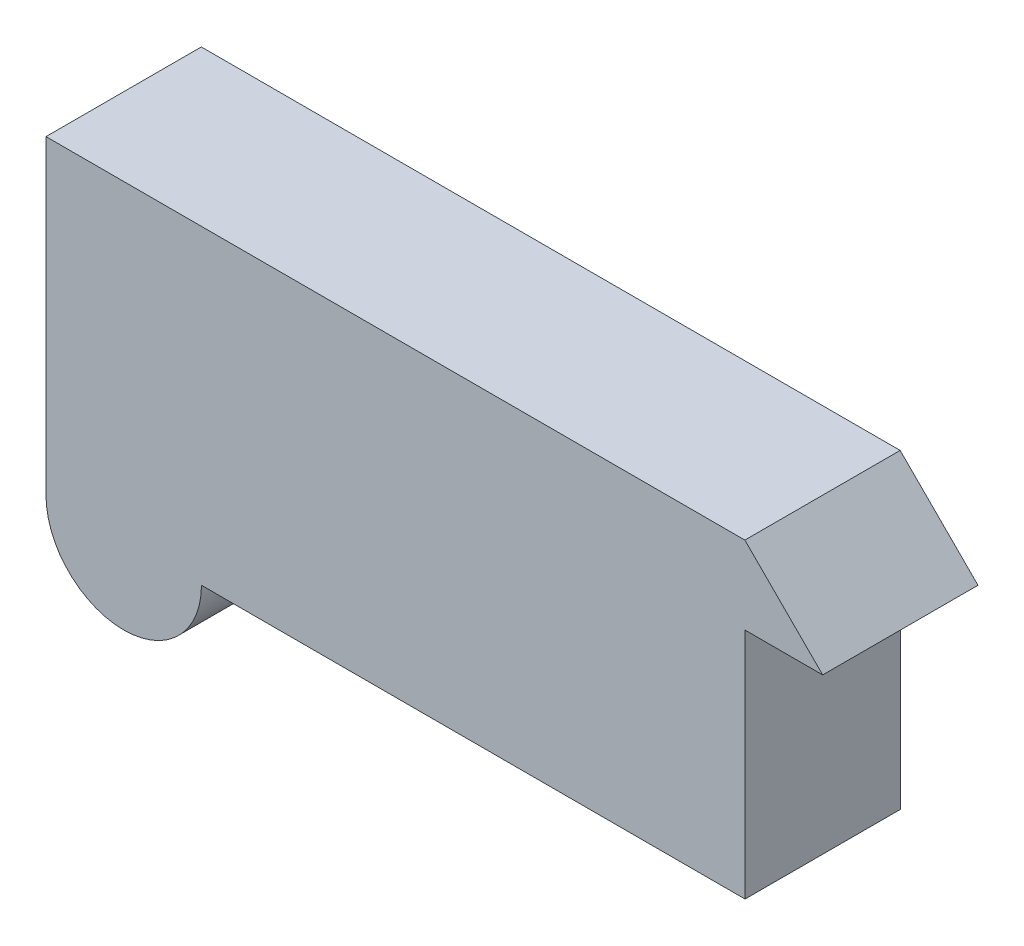
ISO-10303-21;
HEADER;
FILE_DESCRIPTION(('STEP AP214'),'2;1');
FILE_NAME('part.step','',(''),(''),'','','');
FILE_SCHEMA(('AUTOMOTIVE_DESIGN { 1 0 10303 214 1 1 1 1 }'));
ENDSEC;
DATA;
#1=APPLICATION_CONTEXT('core data for automotive mechanical design processes');
#2=APPLICATION_PROTOCOL_DEFINITION('international standard','automotive_design',2000,#1);
#3=PRODUCT_CONTEXT('',#1,'mechanical');
#4=PRODUCT('Part','Part','',(#3));
#5=PRODUCT_RELATED_PRODUCT_CATEGORY('part','',(#4));
#6=PRODUCT_DEFINITION_FORMATION('','',#4);
#7=PRODUCT_DEFINITION_CONTEXT('part definition',#1,'design');
#8=PRODUCT_DEFINITION('design','',#6,#7);
#9=PRODUCT_DEFINITION_SHAPE('','',#8);
#10=(LENGTH_UNIT() NAMED_UNIT(*) SI_UNIT(.MILLI.,.METRE.));
#11=(NAMED_UNIT(*) PLANE_ANGLE_UNIT() SI_UNIT($,.RADIAN.));
#12=(NAMED_UNIT(*) SI_UNIT($,.STERADIAN.) SOLID_ANGLE_UNIT());
#13=UNCERTAINTY_MEASURE_WITH_UNIT(LENGTH_MEASURE(1.E-05),#10,'distance_accuracy_value','');
#14=(GEOMETRIC_REPRESENTATION_CONTEXT(3) GLOBAL_UNCERTAINTY_ASSIGNED_CONTEXT((#13)) GLOBAL_UNIT_ASSIGNED_CONTEXT((#10,
#11,#12)) REPRESENTATION_CONTEXT('',''));
#15=CARTESIAN_POINT('',(0.,0.,0.));
#16=DIRECTION('',(0.,0.,1.));
#17=DIRECTION('',(1.,0.,0.));
#18=AXIS2_PLACEMENT_3D('',#15,#16,#17);
#19=CARTESIAN_POINT('',(-1664.53924544973,1529.86153846154,508.));
#20=DIRECTION('',(1.,0.,0.));
#21=DIRECTION('',(0.,1.,0.));
#22=AXIS2_PLACEMENT_3D('',#19,#20,#21);
#23=PLANE('',#22);
#24=DIRECTION('',(0.,-1.,0.));
#25=VECTOR('',#24,1.);
#26=CARTESIAN_POINT('',(-1664.53924544973,1529.86153846154,0.));
#27=LINE('',#26,#25);
#28=CARTESIAN_POINT('',(-1664.53924544973,1529.86153846154,0.));
#29=VERTEX_POINT('',#28);
#30=CARTESIAN_POINT('',(-1664.53924544973,513.861538461538,0.));
#31=VERTEX_POINT('',#30);
#32=EDGE_CURVE('E138',#29,#31,#27,.T.);
#33=ORIENTED_EDGE('',*,*,#32,.T.);
#34=DIRECTION('',(0.,0.,-1.));
#35=VECTOR('',#34,1.);
#36=CARTESIAN_POINT('',(-1664.53924544973,513.861538461538,508.));
#37=LINE('',#36,#35);
#38=CARTESIAN_POINT('',(-1664.53924544973,513.861538461538,508.));
#39=VERTEX_POINT('',#38);
#40=EDGE_CURVE('E11',#39,#31,#37,.T.);
#41=ORIENTED_EDGE('',*,*,#40,.F.);
#42=DIRECTION('',(0.,-1.,0.));
#43=VECTOR('',#42,1.);
#44=CARTESIAN_POINT('',(-1664.53924544973,1529.86153846154,508.));
#45=LINE('',#44,#43);
#46=CARTESIAN_POINT('',(-1664.53924544973,1529.86153846154,508.));
#47=VERTEX_POINT('',#46);
#48=EDGE_CURVE('E157',#47,#39,#45,.T.);
#49=ORIENTED_EDGE('',*,*,#48,.F.);
#50=DIRECTION('',(0.,0.,-1.));
#51=VECTOR('',#50,1.);
#52=CARTESIAN_POINT('',(-1664.53924544973,1529.86153846154,508.));
#53=LINE('',#52,#51);
#54=EDGE_CURVE('E134',#47,#29,#53,.T.);
#55=ORIENTED_EDGE('',*,*,#54,.T.);
#56=EDGE_LOOP('',(#33,#41,#49,#55));
#57=FACE_BOUND('',#56,.T.);
#58=ADVANCED_FACE('F43',(#57),#23,.F.);
#59=CARTESIAN_POINT('',(-1410.22262920603,513.544922217836,508.));
#60=DIRECTION('',(0.,0.,-1.));
#61=DIRECTION('',(-1.,0.,0.));
#62=AXIS2_PLACEMENT_3D('',#59,#60,#61);
#63=CYLINDRICAL_SURFACE('',#62,254.316813332292);
#64=CARTESIAN_POINT('',(-1410.22262920603,513.544922217836,0.));
#65=DIRECTION('',(0.,0.,1.));
#66=DIRECTION('',(1.,0.,0.));
#67=AXIS2_PLACEMENT_3D('',#64,#65,#66);
#68=CIRCLE('',#67,254.316813332292);
#69=CARTESIAN_POINT('',(-1155.90601296233,513.228305974134,0.));
#70=VERTEX_POINT('',#69);
#71=EDGE_CURVE('E142',#31,#70,#68,.T.);
#72=ORIENTED_EDGE('',*,*,#71,.T.);
#73=DIRECTION('',(0.,0.,-1.));
#74=VECTOR('',#73,1.);
#75=CARTESIAN_POINT('',(-1155.90601296233,513.228305974134,508.));
#76=LINE('',#75,#74);
#77=CARTESIAN_POINT('',(-1155.90601296233,513.228305974134,508.));
#78=VERTEX_POINT('',#77);
#79=EDGE_CURVE('E52',#78,#70,#76,.T.);
#80=ORIENTED_EDGE('',*,*,#79,.F.);
#81=CARTESIAN_POINT('',(-1410.22262920603,513.544922217836,508.));
#82=DIRECTION('',(0.,0.,1.));
#83=DIRECTION('',(1.,0.,0.));
#84=AXIS2_PLACEMENT_3D('',#81,#82,#83);
#85=CIRCLE('',#84,254.316813332292);
#86=EDGE_CURVE('E100',#39,#78,#85,.T.);
#87=ORIENTED_EDGE('',*,*,#86,.F.);
#88=ORIENTED_EDGE('',*,*,#40,.T.);
#89=EDGE_LOOP('',(#72,#80,#87,#88));
#90=FACE_BOUND('',#89,.T.);
#91=ADVANCED_FACE('F191',(#90),#63,.T.);
#92=CARTESIAN_POINT('',(622.093987037673,513.228305974134,508.));
#93=DIRECTION('',(0.,1.,0.));
#94=DIRECTION('',(-1.,0.,0.));
#95=AXIS2_PLACEMENT_3D('',#92,#93,#94);
#96=PLANE('',#95);
#97=DIRECTION('',(1.,0.,0.));
#98=VECTOR('',#97,1.);
#99=CARTESIAN_POINT('',(622.093987037673,513.228305974134,0.));
#100=LINE('',#99,#98);
#101=CARTESIAN_POINT('',(622.093987037673,513.228305974134,0.));
#102=VERTEX_POINT('',#101);
#103=EDGE_CURVE('E145',#70,#102,#100,.T.);
#104=ORIENTED_EDGE('',*,*,#103,.T.);
#105=DIRECTION('',(0.,0.,-1.));
#106=VECTOR('',#105,1.);
#107=CARTESIAN_POINT('',(622.093987037673,513.228305974134,508.));
#108=LINE('',#107,#106);
#109=CARTESIAN_POINT('',(622.093987037673,513.228305974134,508.));
#110=VERTEX_POINT('',#109);
#111=EDGE_CURVE('E164',#110,#102,#108,.T.);
#112=ORIENTED_EDGE('',*,*,#111,.F.);
#113=DIRECTION('',(1.,0.,0.));
#114=VECTOR('',#113,1.);
#115=CARTESIAN_POINT('',(622.093987037673,513.228305974134,508.));
#116=LINE('',#115,#114);
#117=EDGE_CURVE('E174',#78,#110,#116,.T.);
#118=ORIENTED_EDGE('',*,*,#117,.F.);
#119=ORIENTED_EDGE('',*,*,#79,.T.);
#120=EDGE_LOOP('',(#104,#112,#118,#119));
#121=FACE_BOUND('',#120,.T.);
#122=ADVANCED_FACE('F172',(#121),#96,.F.);
#123=CARTESIAN_POINT('',(622.093987037672,1275.22830597413,508.));
#124=DIRECTION('',(-1.,0.,0.));
#125=DIRECTION('',(0.,-1.,0.));
#126=AXIS2_PLACEMENT_3D('',#123,#124,#125);
#127=PLANE('',#126);
#128=DIRECTION('',(0.,1.,0.));
#129=VECTOR('',#128,1.);
#130=CARTESIAN_POINT('',(622.093987037672,1275.22830597413,0.));
#131=LINE('',#130,#129);
#132=CARTESIAN_POINT('',(622.093987037672,1275.22830597413,0.));
#133=VERTEX_POINT('',#132);
#134=EDGE_CURVE('E148',#102,#133,#131,.T.);
#135=ORIENTED_EDGE('',*,*,#134,.T.);
#136=DIRECTION('',(0.,0.,-1.));
#137=VECTOR('',#136,1.);
#138=CARTESIAN_POINT('',(622.093987037672,1275.22830597413,508.));
#139=LINE('',#138,#137);
#140=CARTESIAN_POINT('',(622.093987037672,1275.22830597413,508.));
#141=VERTEX_POINT('',#140);
#142=EDGE_CURVE('E127',#141,#133,#139,.T.);
#143=ORIENTED_EDGE('',*,*,#142,.F.);
#144=DIRECTION('',(0.,1.,0.));
#145=VECTOR('',#144,1.);
#146=CARTESIAN_POINT('',(622.093987037672,1275.22830597413,508.));
#147=LINE('',#146,#145);
#148=EDGE_CURVE('E116',#110,#141,#147,.T.);
#149=ORIENTED_EDGE('',*,*,#148,.F.);
#150=ORIENTED_EDGE('',*,*,#111,.T.);
#151=EDGE_LOOP('',(#135,#143,#149,#150));
#152=FACE_BOUND('',#151,.T.);
#153=ADVANCED_FACE('F180',(#152),#127,.F.);
#154=CARTESIAN_POINT('',(876.093987037672,1275.22830597413,508.));
#155=DIRECTION('',(0.,1.,0.));
#156=DIRECTION('',(-1.,0.,0.));
#157=AXIS2_PLACEMENT_3D('',#154,#155,#156);
#158=PLANE('',#157);
#159=DIRECTION('',(1.,0.,0.));
#160=VECTOR('',#159,1.);
#161=CARTESIAN_POINT('',(876.093987037672,1275.22830597413,0.));
#162=LINE('',#161,#160);
#163=CARTESIAN_POINT('',(876.093987037672,1275.22830597413,0.));
#164=VERTEX_POINT('',#163);
#165=EDGE_CURVE('E125',#133,#164,#162,.T.);
#166=ORIENTED_EDGE('',*,*,#165,.T.);
#167=DIRECTION('',(0.,0.,-1.));
#168=VECTOR('',#167,1.);
#169=CARTESIAN_POINT('',(876.093987037672,1275.22830597413,508.));
#170=LINE('',#169,#168);
#171=CARTESIAN_POINT('',(876.093987037672,1275.22830597413,508.));
#172=VERTEX_POINT('',#171);
#173=EDGE_CURVE('E122',#172,#164,#170,.T.);
#174=ORIENTED_EDGE('',*,*,#173,.F.);
#175=DIRECTION('',(1.,0.,0.));
#176=VECTOR('',#175,1.);
#177=CARTESIAN_POINT('',(876.093987037672,1275.22830597413,508.));
#178=LINE('',#177,#176);
#179=EDGE_CURVE('E110',#141,#172,#178,.T.);
#180=ORIENTED_EDGE('',*,*,#179,.F.);
#181=ORIENTED_EDGE('',*,*,#142,.T.);
#182=EDGE_LOOP('',(#166,#174,#180,#181));
#183=FACE_BOUND('',#182,.T.);
#184=ADVANCED_FACE('F123',(#183),#158,.F.);
#185=CARTESIAN_POINT('',(621.460754550269,1529.86153846154,508.));
#186=DIRECTION('',(-0.707106781186549,-0.707106781186546,0.));
#187=DIRECTION('',(0.707106781186546,-0.707106781186549,0.));
#188=AXIS2_PLACEMENT_3D('',#185,#186,#187);
#189=PLANE('',#188);
#190=DIRECTION('',(-0.707106781186546,0.707106781186549,0.));
#191=VECTOR('',#190,1.);
#192=CARTESIAN_POINT('',(621.460754550269,1529.86153846154,0.));
#193=LINE('',#192,#191);
#194=CARTESIAN_POINT('',(621.460754550269,1529.86153846154,0.));
#195=VERTEX_POINT('',#194);
#196=EDGE_CURVE('E86',#164,#195,#193,.T.);
#197=ORIENTED_EDGE('',*,*,#196,.T.);
#198=DIRECTION('',(0.,0.,-1.));
#199=VECTOR('',#198,1.);
#200=CARTESIAN_POINT('',(621.460754550269,1529.86153846154,508.));
#201=LINE('',#200,#199);
#202=CARTESIAN_POINT('',(621.460754550269,1529.86153846154,508.));
#203=VERTEX_POINT('',#202);
#204=EDGE_CURVE('E128',#203,#195,#201,.T.);
#205=ORIENTED_EDGE('',*,*,#204,.F.);
#206=DIRECTION('',(-0.707106781186546,0.707106781186549,0.));
#207=VECTOR('',#206,1.);
#208=CARTESIAN_POINT('',(621.460754550269,1529.86153846154,508.));
#209=LINE('',#208,#207);
#210=EDGE_CURVE('E114',#172,#203,#209,.T.);
#211=ORIENTED_EDGE('',*,*,#210,.F.);
#212=ORIENTED_EDGE('',*,*,#173,.T.);
#213=EDGE_LOOP('',(#197,#205,#211,#212));
#214=FACE_BOUND('',#213,.T.);
#215=ADVANCED_FACE('F130',(#214),#189,.F.);
#216=CARTESIAN_POINT('',(-1664.53924544973,1529.86153846154,508.));
#217=DIRECTION('',(0.,-1.,0.));
#218=DIRECTION('',(0.,0.,-1.));
#219=AXIS2_PLACEMENT_3D('',#216,#217,#218);
#220=PLANE('',#219);
#221=DIRECTION('',(-1.,0.,0.));
#222=VECTOR('',#221,1.);
#223=CARTESIAN_POINT('',(-1664.53924544973,1529.86153846154,0.));
#224=LINE('',#223,#222);
#225=EDGE_CURVE('E92',#195,#29,#224,.T.);
#226=ORIENTED_EDGE('',*,*,#225,.T.);
#227=ORIENTED_EDGE('',*,*,#54,.F.);
#228=DIRECTION('',(-1.,0.,0.));
#229=VECTOR('',#228,1.);
#230=CARTESIAN_POINT('',(-1664.53924544973,1529.86153846154,508.));
#231=LINE('',#230,#229);
#232=EDGE_CURVE('E60',#203,#47,#231,.T.);
#233=ORIENTED_EDGE('',*,*,#232,.F.);
#234=ORIENTED_EDGE('',*,*,#204,.T.);
#235=EDGE_LOOP('',(#226,#227,#233,#234));
#236=FACE_BOUND('',#235,.T.);
#237=ADVANCED_FACE('F205',(#236),#220,.F.);
#238=CARTESIAN_POINT('',(-1410.22262920603,513.544922217836,508.));
#239=DIRECTION('',(0.,0.,1.));
#240=DIRECTION('',(1.,0.,0.));
#241=AXIS2_PLACEMENT_3D('',#238,#239,#240);
#242=PLANE('',#241);
#243=ORIENTED_EDGE('',*,*,#48,.T.);
#244=ORIENTED_EDGE('',*,*,#86,.T.);
#245=ORIENTED_EDGE('',*,*,#117,.T.);
#246=ORIENTED_EDGE('',*,*,#148,.T.);
#247=ORIENTED_EDGE('',*,*,#179,.T.);
#248=ORIENTED_EDGE('',*,*,#210,.T.);
#249=ORIENTED_EDGE('',*,*,#232,.T.);
#250=EDGE_LOOP('',(#243,#244,#245,#246,#247,#248,#249));
#251=FACE_BOUND('',#250,.T.);
#252=ADVANCED_FACE('F112',(#251),#242,.T.);
#253=CARTESIAN_POINT('',(-1410.22262920603,513.544922217836,0.));
#254=DIRECTION('',(0.,0.,1.));
#255=DIRECTION('',(1.,0.,0.));
#256=AXIS2_PLACEMENT_3D('',#253,#254,#255);
#257=PLANE('',#256);
#258=ORIENTED_EDGE('',*,*,#32,.F.);
#259=ORIENTED_EDGE('',*,*,#225,.F.);
#260=ORIENTED_EDGE('',*,*,#196,.F.);
#261=ORIENTED_EDGE('',*,*,#165,.F.);
#262=ORIENTED_EDGE('',*,*,#134,.F.);
#263=ORIENTED_EDGE('',*,*,#103,.F.);
#264=ORIENTED_EDGE('',*,*,#71,.F.);
#265=EDGE_LOOP('',(#258,#259,#260,#261,#262,#263,#264));
#266=FACE_BOUND('',#265,.T.);
#267=ADVANCED_FACE('F178',(#266),#257,.F.);
#268=CLOSED_SHELL('',(#58,#91,#122,#153,#184,#215,#237,#252,#267));
#269=MANIFOLD_SOLID_BREP('B2',#268);
#270=ADVANCED_BREP_SHAPE_REPRESENTATION('',(#18,#269),#14);
#271=SHAPE_DEFINITION_REPRESENTATION(#9,#270);
ENDSEC;
END-ISO-10303-21;
